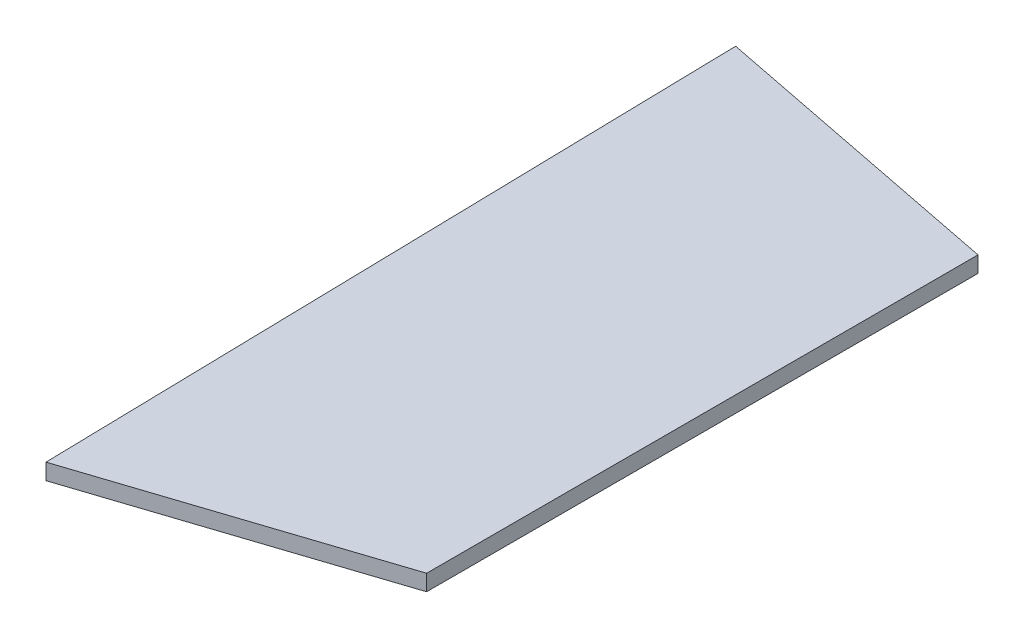
ISO-10303-21;
HEADER;
FILE_DESCRIPTION(('STEP AP214'),'2;1');
FILE_NAME('part.step','',(''),(''),'','','');
FILE_SCHEMA(('AUTOMOTIVE_DESIGN { 1 0 10303 214 1 1 1 1 }'));
ENDSEC;
DATA;
#1=APPLICATION_CONTEXT('core data for automotive mechanical design processes');
#2=APPLICATION_PROTOCOL_DEFINITION('international standard','automotive_design',2000,#1);
#3=PRODUCT_CONTEXT('',#1,'mechanical');
#4=PRODUCT('Part','Part','',(#3));
#5=PRODUCT_RELATED_PRODUCT_CATEGORY('part','',(#4));
#6=PRODUCT_DEFINITION_FORMATION('','',#4);
#7=PRODUCT_DEFINITION_CONTEXT('part definition',#1,'design');
#8=PRODUCT_DEFINITION('design','',#6,#7);
#9=PRODUCT_DEFINITION_SHAPE('','',#8);
#10=(LENGTH_UNIT() NAMED_UNIT(*) SI_UNIT(.MILLI.,.METRE.));
#11=(NAMED_UNIT(*) PLANE_ANGLE_UNIT() SI_UNIT($,.RADIAN.));
#12=(NAMED_UNIT(*) SI_UNIT($,.STERADIAN.) SOLID_ANGLE_UNIT());
#13=UNCERTAINTY_MEASURE_WITH_UNIT(LENGTH_MEASURE(1.E-05),#10,'distance_accuracy_value','');
#14=(GEOMETRIC_REPRESENTATION_CONTEXT(3) GLOBAL_UNCERTAINTY_ASSIGNED_CONTEXT((#13)) GLOBAL_UNIT_ASSIGNED_CONTEXT((#10,
#11,#12)) REPRESENTATION_CONTEXT('',''));
#15=CARTESIAN_POINT('',(0.,0.,0.));
#16=DIRECTION('',(0.,0.,1.));
#17=DIRECTION('',(1.,0.,0.));
#18=AXIS2_PLACEMENT_3D('',#15,#16,#17);
#19=CARTESIAN_POINT('',(35.6488836122115,2.,-11.7057693942691));
#20=DIRECTION('',(-1.,0.,0.));
#21=DIRECTION('',(0.,0.,1.));
#22=AXIS2_PLACEMENT_3D('',#19,#20,#21);
#23=PLANE('',#22);
#24=DIRECTION('',(0.,0.,-1.));
#25=VECTOR('',#24,1.);
#26=CARTESIAN_POINT('',(35.6488836122115,0.,-11.7057693942691));
#27=LINE('',#26,#25);
#28=CARTESIAN_POINT('',(35.6488836122115,0.,-11.7057693942691));
#29=VERTEX_POINT('',#28);
#30=CARTESIAN_POINT('',(35.6488836122115,0.,-80.3076935677468));
#31=VERTEX_POINT('',#30);
#32=EDGE_CURVE('E107',#29,#31,#27,.T.);
#33=ORIENTED_EDGE('',*,*,#32,.T.);
#34=DIRECTION('',(0.,-1.,0.));
#35=VECTOR('',#34,1.);
#36=CARTESIAN_POINT('',(35.6488836122115,2.,-80.3076935677468));
#37=LINE('',#36,#35);
#38=CARTESIAN_POINT('',(35.6488836122115,2.,-80.3076935677468));
#39=VERTEX_POINT('',#38);
#40=EDGE_CURVE('E11',#39,#31,#37,.T.);
#41=ORIENTED_EDGE('',*,*,#40,.F.);
#42=DIRECTION('',(0.,0.,-1.));
#43=VECTOR('',#42,1.);
#44=CARTESIAN_POINT('',(35.6488836122115,2.,-11.7057693942691));
#45=LINE('',#44,#43);
#46=CARTESIAN_POINT('',(35.6488836122115,2.,-11.7057693942691));
#47=VERTEX_POINT('',#46);
#48=EDGE_CURVE('E90',#47,#39,#45,.T.);
#49=ORIENTED_EDGE('',*,*,#48,.F.);
#50=DIRECTION('',(0.,-1.,0.));
#51=VECTOR('',#50,1.);
#52=CARTESIAN_POINT('',(35.6488836122115,2.,-11.7057693942691));
#53=LINE('',#52,#51);
#54=EDGE_CURVE('E103',#47,#29,#53,.T.);
#55=ORIENTED_EDGE('',*,*,#54,.T.);
#56=EDGE_LOOP('',(#33,#41,#49,#55));
#57=FACE_BOUND('',#56,.T.);
#58=ADVANCED_FACE('F39',(#57),#23,.F.);
#59=CARTESIAN_POINT('',(35.6488836122115,2.,-80.3076935677468));
#60=DIRECTION('',(-0.193510006813888,0.,0.981098301528898));
#61=DIRECTION('',(0.981098301528899,0.,0.193510006813888));
#62=AXIS2_PLACEMENT_3D('',#59,#60,#61);
#63=PLANE('',#62);
#64=DIRECTION('',(-0.981098301528898,0.,-0.193510006813888));
#65=VECTOR('',#64,1.);
#66=CARTESIAN_POINT('',(35.6488836122115,0.,-80.3076935677468));
#67=LINE('',#66,#65);
#68=CARTESIAN_POINT('',(-1.91205593602473,0.,-87.7161435228517));
#69=VERTEX_POINT('',#68);
#70=EDGE_CURVE('E96',#31,#69,#67,.T.);
#71=ORIENTED_EDGE('',*,*,#70,.T.);
#72=DIRECTION('',(0.,-1.,0.));
#73=VECTOR('',#72,1.);
#74=CARTESIAN_POINT('',(-1.91205593602473,2.,-87.7161435228517));
#75=LINE('',#74,#73);
#76=CARTESIAN_POINT('',(-1.91205593602473,2.,-87.7161435228517));
#77=VERTEX_POINT('',#76);
#78=EDGE_CURVE('E48',#77,#69,#75,.T.);
#79=ORIENTED_EDGE('',*,*,#78,.F.);
#80=DIRECTION('',(-0.981098301528898,0.,-0.193510006813888));
#81=VECTOR('',#80,1.);
#82=CARTESIAN_POINT('',(35.6488836122115,2.,-80.3076935677468));
#83=LINE('',#82,#81);
#84=EDGE_CURVE('E85',#39,#77,#83,.T.);
#85=ORIENTED_EDGE('',*,*,#84,.F.);
#86=ORIENTED_EDGE('',*,*,#40,.T.);
#87=EDGE_LOOP('',(#71,#79,#85,#86));
#88=FACE_BOUND('',#87,.T.);
#89=ADVANCED_FACE('F95',(#88),#63,.F.);
#90=CARTESIAN_POINT('',(-1.85493564854622,2.,-85.0957330839456));
#91=DIRECTION('',(0.999762503400889,0.,-0.0217930446149243));
#92=DIRECTION('',(-0.0217930446149243,0.,-0.999762503400889));
#93=AXIS2_PLACEMENT_3D('',#90,#91,#92);
#94=PLANE('',#93);
#95=DIRECTION('',(0.0217930446149243,0.,0.999762503400889));
#96=VECTOR('',#95,1.);
#97=CARTESIAN_POINT('',(-1.85493564854622,0.,-85.0957330839456));
#98=LINE('',#97,#96);
#99=CARTESIAN_POINT('',(0.,0.,0.));
#100=VERTEX_POINT('',#99);
#101=EDGE_CURVE('E72',#69,#100,#98,.T.);
#102=ORIENTED_EDGE('',*,*,#101,.T.);
#103=DIRECTION('',(0.,-1.,0.));
#104=VECTOR('',#103,1.);
#105=CARTESIAN_POINT('',(0.,2.,0.));
#106=LINE('',#105,#104);
#107=CARTESIAN_POINT('',(0.,2.,0.));
#108=VERTEX_POINT('',#107);
#109=EDGE_CURVE('E98',#108,#100,#106,.T.);
#110=ORIENTED_EDGE('',*,*,#109,.F.);
#111=DIRECTION('',(0.0217930446149231,0.,0.999762503400889));
#112=VECTOR('',#111,1.);
#113=CARTESIAN_POINT('',(-1.91205593602473,2.,-87.7161435228517));
#114=LINE('',#113,#112);
#115=EDGE_CURVE('E88',#77,#108,#114,.T.);
#116=ORIENTED_EDGE('',*,*,#115,.F.);
#117=ORIENTED_EDGE('',*,*,#78,.T.);
#118=EDGE_LOOP('',(#102,#110,#116,#117));
#119=FACE_BOUND('',#118,.T.);
#120=ADVANCED_FACE('F99',(#119),#94,.F.);
#121=CARTESIAN_POINT('',(0.,2.,0.));
#122=DIRECTION('',(-0.311974433345891,0.,-0.95009049723619));
#123=DIRECTION('',(-0.95009049723619,0.,0.311974433345891));
#124=AXIS2_PLACEMENT_3D('',#121,#122,#123);
#125=PLANE('',#124);
#126=DIRECTION('',(0.95009049723619,0.,-0.311974433345891));
#127=VECTOR('',#126,1.);
#128=CARTESIAN_POINT('',(0.,0.,0.));
#129=LINE('',#128,#127);
#130=EDGE_CURVE('E78',#100,#29,#129,.T.);
#131=ORIENTED_EDGE('',*,*,#130,.T.);
#132=ORIENTED_EDGE('',*,*,#54,.F.);
#133=DIRECTION('',(0.95009049723619,0.,-0.311974433345891));
#134=VECTOR('',#133,1.);
#135=CARTESIAN_POINT('',(0.,2.,0.));
#136=LINE('',#135,#134);
#137=EDGE_CURVE('E56',#108,#47,#136,.T.);
#138=ORIENTED_EDGE('',*,*,#137,.F.);
#139=ORIENTED_EDGE('',*,*,#109,.T.);
#140=EDGE_LOOP('',(#131,#132,#138,#139));
#141=FACE_BOUND('',#140,.T.);
#142=ADVANCED_FACE('F120',(#141),#125,.F.);
#143=CARTESIAN_POINT('',(0.,2.,0.));
#144=DIRECTION('',(0.,1.,0.));
#145=DIRECTION('',(0.,0.,1.));
#146=AXIS2_PLACEMENT_3D('',#143,#144,#145);
#147=PLANE('',#146);
#148=ORIENTED_EDGE('',*,*,#48,.T.);
#149=ORIENTED_EDGE('',*,*,#84,.T.);
#150=ORIENTED_EDGE('',*,*,#115,.T.);
#151=ORIENTED_EDGE('',*,*,#137,.T.);
#152=EDGE_LOOP('',(#148,#149,#150,#151));
#153=FACE_BOUND('',#152,.T.);
#154=ADVANCED_FACE('F86',(#153),#147,.T.);
#155=CARTESIAN_POINT('',(0.,0.,0.));
#156=DIRECTION('',(0.,1.,0.));
#157=DIRECTION('',(0.,0.,1.));
#158=AXIS2_PLACEMENT_3D('',#155,#156,#157);
#159=PLANE('',#158);
#160=ORIENTED_EDGE('',*,*,#32,.F.);
#161=ORIENTED_EDGE('',*,*,#130,.F.);
#162=ORIENTED_EDGE('',*,*,#101,.F.);
#163=ORIENTED_EDGE('',*,*,#70,.F.);
#164=EDGE_LOOP('',(#160,#161,#162,#163));
#165=FACE_BOUND('',#164,.T.);
#166=ADVANCED_FACE('F123',(#165),#159,.F.);
#167=CLOSED_SHELL('',(#58,#89,#120,#142,#154,#166));
#168=MANIFOLD_SOLID_BREP('B2',#167);
#169=ADVANCED_BREP_SHAPE_REPRESENTATION('',(#18,#168),#14);
#170=SHAPE_DEFINITION_REPRESENTATION(#9,#169);
ENDSEC;
END-ISO-10303-21;
